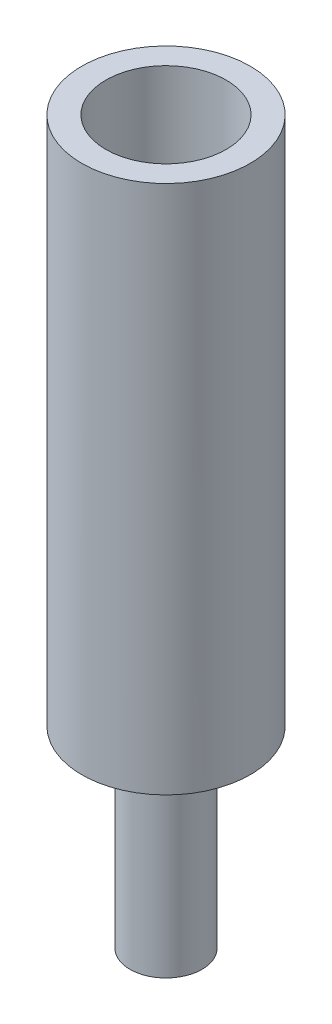
ISO-10303-21;
HEADER;
FILE_DESCRIPTION(('STEP AP214'),'2;1');
FILE_NAME('part.step','',(''),(''),'','','');
FILE_SCHEMA(('AUTOMOTIVE_DESIGN { 1 0 10303 214 1 1 1 1 }'));
ENDSEC;
DATA;
#1=APPLICATION_CONTEXT('core data for automotive mechanical design processes');
#2=APPLICATION_PROTOCOL_DEFINITION('international standard','automotive_design',2000,#1);
#3=PRODUCT_CONTEXT('',#1,'mechanical');
#4=PRODUCT('Part','Part','',(#3));
#5=PRODUCT_RELATED_PRODUCT_CATEGORY('part','',(#4));
#6=PRODUCT_DEFINITION_FORMATION('','',#4);
#7=PRODUCT_DEFINITION_CONTEXT('part definition',#1,'design');
#8=PRODUCT_DEFINITION('design','',#6,#7);
#9=PRODUCT_DEFINITION_SHAPE('','',#8);
#10=(LENGTH_UNIT() NAMED_UNIT(*) SI_UNIT(.MILLI.,.METRE.));
#11=(NAMED_UNIT(*) PLANE_ANGLE_UNIT() SI_UNIT($,.RADIAN.));
#12=(NAMED_UNIT(*) SI_UNIT($,.STERADIAN.) SOLID_ANGLE_UNIT());
#13=UNCERTAINTY_MEASURE_WITH_UNIT(LENGTH_MEASURE(1.E-05),#10,'distance_accuracy_value','');
#14=(GEOMETRIC_REPRESENTATION_CONTEXT(3) GLOBAL_UNCERTAINTY_ASSIGNED_CONTEXT((#13)) GLOBAL_UNIT_ASSIGNED_CONTEXT((#10,
#11,#12)) REPRESENTATION_CONTEXT('',''));
#15=CARTESIAN_POINT('',(0.,0.,0.));
#16=DIRECTION('',(0.,0.,1.));
#17=DIRECTION('',(1.,0.,0.));
#18=AXIS2_PLACEMENT_3D('',#15,#16,#17);
#19=CARTESIAN_POINT('',(0.,30.,0.));
#20=DIRECTION('',(0.,-1.,0.));
#21=DIRECTION('',(0.,0.,-1.));
#22=AXIS2_PLACEMENT_3D('',#19,#20,#21);
#23=CYLINDRICAL_SURFACE('',#22,3.5);
#24=CARTESIAN_POINT('',(0.,30.,0.));
#25=DIRECTION('',(0.,1.,0.));
#26=DIRECTION('',(0.,0.,1.));
#27=AXIS2_PLACEMENT_3D('',#24,#25,#26);
#28=CIRCLE('',#27,3.5);
#29=CARTESIAN_POINT('',(0.,30.,3.5));
#30=VERTEX_POINT('',#29);
#31=EDGE_CURVE('E11',#30,#30,#28,.T.);
#32=ORIENTED_EDGE('',*,*,#31,.F.);
#33=EDGE_LOOP('',(#32));
#34=FACE_BOUND('',#33,.T.);
#35=CARTESIAN_POINT('',(0.,8.,0.));
#36=DIRECTION('',(0.,-1.,0.));
#37=DIRECTION('',(0.,0.,-1.));
#38=AXIS2_PLACEMENT_3D('',#35,#36,#37);
#39=CIRCLE('',#38,3.5);
#40=CARTESIAN_POINT('',(0.,8.,-3.5));
#41=VERTEX_POINT('',#40);
#42=EDGE_CURVE('E61',#41,#41,#39,.T.);
#43=ORIENTED_EDGE('',*,*,#42,.F.);
#44=EDGE_LOOP('',(#43));
#45=FACE_BOUND('',#44,.T.);
#46=ADVANCED_FACE('F43',(#34,#45),#23,.T.);
#47=CARTESIAN_POINT('',(0.,30.,0.));
#48=DIRECTION('',(0.,1.,0.));
#49=DIRECTION('',(0.,0.,1.));
#50=AXIS2_PLACEMENT_3D('',#47,#48,#49);
#51=PLANE('',#50);
#52=CARTESIAN_POINT('',(0.,30.,0.));
#53=DIRECTION('',(0.,1.,0.));
#54=DIRECTION('',(0.,0.,1.));
#55=AXIS2_PLACEMENT_3D('',#52,#53,#54);
#56=CIRCLE('',#55,2.5);
#57=CARTESIAN_POINT('',(0.,30.,2.5));
#58=VERTEX_POINT('',#57);
#59=EDGE_CURVE('E55',#58,#58,#56,.T.);
#60=ORIENTED_EDGE('',*,*,#59,.F.);
#61=EDGE_LOOP('',(#60));
#62=FACE_BOUND('',#61,.T.);
#63=ORIENTED_EDGE('',*,*,#31,.T.);
#64=EDGE_LOOP('',(#63));
#65=FACE_BOUND('',#64,.T.);
#66=ADVANCED_FACE('F86',(#62,#65),#51,.T.);
#67=CARTESIAN_POINT('',(0.,10.,0.));
#68=DIRECTION('',(0.,1.,0.));
#69=DIRECTION('',(0.,0.,1.));
#70=AXIS2_PLACEMENT_3D('',#67,#68,#69);
#71=CYLINDRICAL_SURFACE('',#70,2.5);
#72=CARTESIAN_POINT('',(0.,10.,0.));
#73=DIRECTION('',(0.,1.,0.));
#74=DIRECTION('',(0.,0.,1.));
#75=AXIS2_PLACEMENT_3D('',#72,#73,#74);
#76=CIRCLE('',#75,2.5);
#77=CARTESIAN_POINT('',(0.,10.,2.5));
#78=VERTEX_POINT('',#77);
#79=EDGE_CURVE('E50',#78,#78,#76,.T.);
#80=ORIENTED_EDGE('',*,*,#79,.F.);
#81=EDGE_LOOP('',(#80));
#82=FACE_BOUND('',#81,.T.);
#83=ORIENTED_EDGE('',*,*,#59,.T.);
#84=EDGE_LOOP('',(#83));
#85=FACE_BOUND('',#84,.T.);
#86=ADVANCED_FACE('F91',(#82,#85),#71,.F.);
#87=CARTESIAN_POINT('',(0.,10.,0.));
#88=DIRECTION('',(0.,1.,0.));
#89=DIRECTION('',(0.,0.,1.));
#90=AXIS2_PLACEMENT_3D('',#87,#88,#89);
#91=PLANE('',#90);
#92=ORIENTED_EDGE('',*,*,#79,.T.);
#93=EDGE_LOOP('',(#92));
#94=FACE_BOUND('',#93,.T.);
#95=ADVANCED_FACE('F81',(#94),#91,.T.);
#96=CARTESIAN_POINT('',(0.,8.,0.));
#97=DIRECTION('',(0.,-1.,0.));
#98=DIRECTION('',(0.,0.,-1.));
#99=AXIS2_PLACEMENT_3D('',#96,#97,#98);
#100=PLANE('',#99);
#101=CARTESIAN_POINT('',(0.,8.,0.));
#102=DIRECTION('',(0.,-1.,0.));
#103=DIRECTION('',(0.,0.,-1.));
#104=AXIS2_PLACEMENT_3D('',#101,#102,#103);
#105=CIRCLE('',#104,1.5);
#106=CARTESIAN_POINT('',(0.,8.,-1.5));
#107=VERTEX_POINT('',#106);
#108=EDGE_CURVE('E66',#107,#107,#105,.T.);
#109=ORIENTED_EDGE('',*,*,#108,.F.);
#110=EDGE_LOOP('',(#109));
#111=FACE_BOUND('',#110,.T.);
#112=ORIENTED_EDGE('',*,*,#42,.T.);
#113=EDGE_LOOP('',(#112));
#114=FACE_BOUND('',#113,.T.);
#115=ADVANCED_FACE('F78',(#111,#114),#100,.T.);
#116=CARTESIAN_POINT('',(0.,8.,0.));
#117=DIRECTION('',(0.,-1.,0.));
#118=DIRECTION('',(0.,0.,-1.));
#119=AXIS2_PLACEMENT_3D('',#116,#117,#118);
#120=CYLINDRICAL_SURFACE('',#119,1.5);
#121=ORIENTED_EDGE('',*,*,#108,.T.);
#122=EDGE_LOOP('',(#121));
#123=FACE_BOUND('',#122,.T.);
#124=CARTESIAN_POINT('',(0.,0.,0.));
#125=DIRECTION('',(0.,-1.,0.));
#126=DIRECTION('',(0.,0.,-1.));
#127=AXIS2_PLACEMENT_3D('',#124,#125,#126);
#128=CIRCLE('',#127,1.5);
#129=CARTESIAN_POINT('',(0.,0.,-1.5));
#130=VERTEX_POINT('',#129);
#131=EDGE_CURVE('E67',#130,#130,#128,.T.);
#132=ORIENTED_EDGE('',*,*,#131,.F.);
#133=EDGE_LOOP('',(#132));
#134=FACE_BOUND('',#133,.T.);
#135=ADVANCED_FACE('F75',(#123,#134),#120,.T.);
#136=CARTESIAN_POINT('',(0.,0.,0.));
#137=DIRECTION('',(0.,1.,0.));
#138=DIRECTION('',(0.,0.,1.));
#139=AXIS2_PLACEMENT_3D('',#136,#137,#138);
#140=PLANE('',#139);
#141=ORIENTED_EDGE('',*,*,#131,.T.);
#142=EDGE_LOOP('',(#141));
#143=FACE_BOUND('',#142,.T.);
#144=ADVANCED_FACE('F101',(#143),#140,.F.);
#145=CLOSED_SHELL('',(#46,#66,#86,#95,#115,#135,#144));
#146=MANIFOLD_SOLID_BREP('B2',#145);
#147=ADVANCED_BREP_SHAPE_REPRESENTATION('',(#18,#146),#14);
#148=SHAPE_DEFINITION_REPRESENTATION(#9,#147);
ENDSEC;
END-ISO-10303-21;
